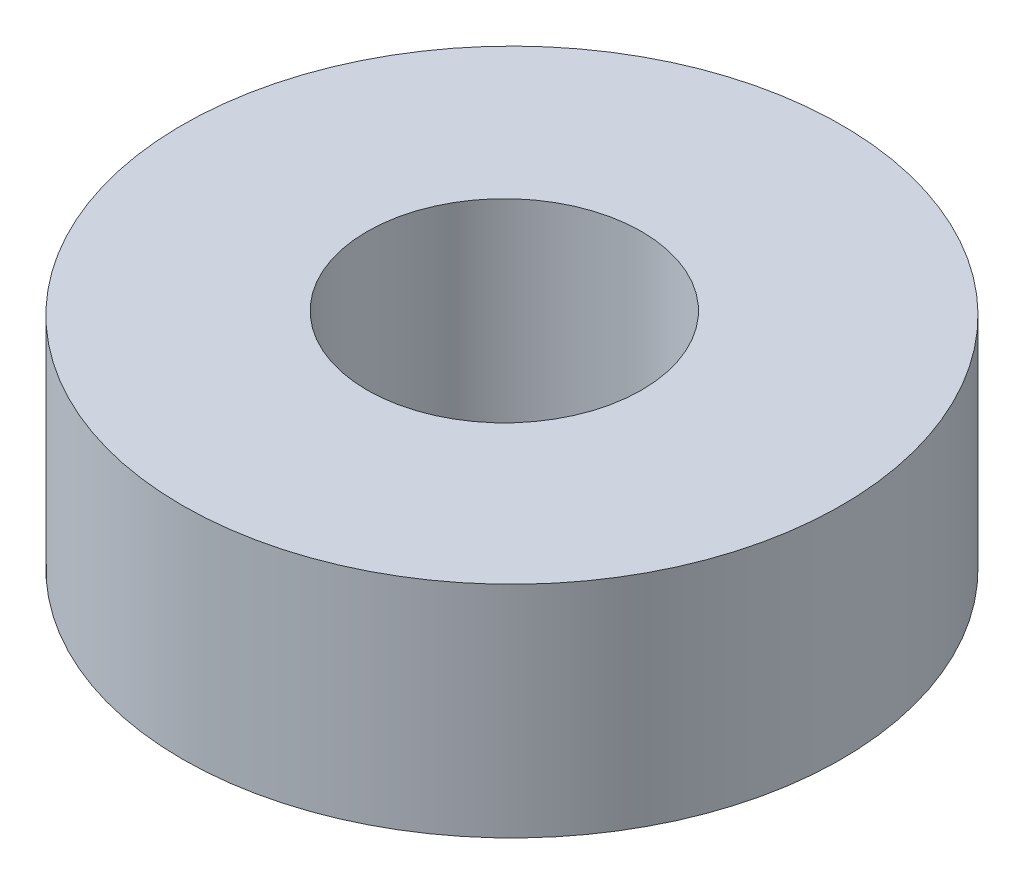
ISO-10303-21;
HEADER;
FILE_DESCRIPTION(('STEP AP214'),'2;1');
FILE_NAME('part.step','',(''),(''),'','','');
FILE_SCHEMA(('AUTOMOTIVE_DESIGN { 1 0 10303 214 1 1 1 1 }'));
ENDSEC;
DATA;
#1=APPLICATION_CONTEXT('core data for automotive mechanical design processes');
#2=APPLICATION_PROTOCOL_DEFINITION('international standard','automotive_design',2000,#1);
#3=PRODUCT_CONTEXT('',#1,'mechanical');
#4=PRODUCT('Part','Part','',(#3));
#5=PRODUCT_RELATED_PRODUCT_CATEGORY('part','',(#4));
#6=PRODUCT_DEFINITION_FORMATION('','',#4);
#7=PRODUCT_DEFINITION_CONTEXT('part definition',#1,'design');
#8=PRODUCT_DEFINITION('design','',#6,#7);
#9=PRODUCT_DEFINITION_SHAPE('','',#8);
#10=(LENGTH_UNIT() NAMED_UNIT(*) SI_UNIT(.MILLI.,.METRE.));
#11=(NAMED_UNIT(*) PLANE_ANGLE_UNIT() SI_UNIT($,.RADIAN.));
#12=(NAMED_UNIT(*) SI_UNIT($,.STERADIAN.) SOLID_ANGLE_UNIT());
#13=UNCERTAINTY_MEASURE_WITH_UNIT(LENGTH_MEASURE(1.E-05),#10,'distance_accuracy_value','');
#14=(GEOMETRIC_REPRESENTATION_CONTEXT(3) GLOBAL_UNCERTAINTY_ASSIGNED_CONTEXT((#13)) GLOBAL_UNIT_ASSIGNED_CONTEXT((#10,
#11,#12)) REPRESENTATION_CONTEXT('',''));
#15=CARTESIAN_POINT('',(0.,0.,0.));
#16=DIRECTION('',(0.,0.,1.));
#17=DIRECTION('',(1.,0.,0.));
#18=AXIS2_PLACEMENT_3D('',#15,#16,#17);
#19=CARTESIAN_POINT('',(0.138632130818502,4.,0.));
#20=DIRECTION('',(0.,1.,0.));
#21=DIRECTION('',(0.,0.,1.));
#22=AXIS2_PLACEMENT_3D('',#19,#20,#21);
#23=PLANE('',#22);
#24=CARTESIAN_POINT('',(0.138632130818502,4.,0.));
#25=DIRECTION('',(0.,1.,0.));
#26=DIRECTION('',(0.,0.,1.));
#27=AXIS2_PLACEMENT_3D('',#24,#25,#26);
#28=CIRCLE('',#27,6.);
#29=CARTESIAN_POINT('',(0.138632130818502,4.,6.));
#30=VERTEX_POINT('',#29);
#31=EDGE_CURVE('E10',#30,#30,#28,.T.);
#32=ORIENTED_EDGE('',*,*,#31,.T.);
#33=EDGE_LOOP('',(#32));
#34=FACE_BOUND('',#33,.T.);
#35=CARTESIAN_POINT('',(0.,4.,0.));
#36=DIRECTION('',(0.,1.,0.));
#37=DIRECTION('',(0.,0.,1.));
#38=AXIS2_PLACEMENT_3D('',#35,#36,#37);
#39=CIRCLE('',#38,2.5);
#40=CARTESIAN_POINT('',(0.,4.,2.5));
#41=VERTEX_POINT('',#40);
#42=EDGE_CURVE('E42',#41,#41,#39,.T.);
#43=ORIENTED_EDGE('',*,*,#42,.F.);
#44=EDGE_LOOP('',(#43));
#45=FACE_BOUND('',#44,.T.);
#46=ADVANCED_FACE('F31',(#34,#45),#23,.T.);
#47=CARTESIAN_POINT('',(0.138632130818502,0.,0.));
#48=DIRECTION('',(0.,1.,0.));
#49=DIRECTION('',(0.,0.,1.));
#50=AXIS2_PLACEMENT_3D('',#47,#48,#49);
#51=PLANE('',#50);
#52=CARTESIAN_POINT('',(0.138632130818502,0.,0.));
#53=DIRECTION('',(0.,1.,0.));
#54=DIRECTION('',(0.,0.,1.));
#55=AXIS2_PLACEMENT_3D('',#52,#53,#54);
#56=CIRCLE('',#55,6.);
#57=CARTESIAN_POINT('',(0.138632130818502,0.,6.));
#58=VERTEX_POINT('',#57);
#59=EDGE_CURVE('E35',#58,#58,#56,.T.);
#60=ORIENTED_EDGE('',*,*,#59,.F.);
#61=EDGE_LOOP('',(#60));
#62=FACE_BOUND('',#61,.T.);
#63=CARTESIAN_POINT('',(0.,0.,0.));
#64=DIRECTION('',(0.,1.,0.));
#65=DIRECTION('',(0.,0.,1.));
#66=AXIS2_PLACEMENT_3D('',#63,#64,#65);
#67=CIRCLE('',#66,2.5);
#68=CARTESIAN_POINT('',(0.,0.,2.5));
#69=VERTEX_POINT('',#68);
#70=EDGE_CURVE('E44',#69,#69,#67,.T.);
#71=ORIENTED_EDGE('',*,*,#70,.T.);
#72=EDGE_LOOP('',(#71));
#73=FACE_BOUND('',#72,.T.);
#74=ADVANCED_FACE('F54',(#62,#73),#51,.F.);
#75=CARTESIAN_POINT('',(0.138632130818502,4.,0.));
#76=DIRECTION('',(0.,-1.,0.));
#77=DIRECTION('',(0.,0.,-1.));
#78=AXIS2_PLACEMENT_3D('',#75,#76,#77);
#79=CYLINDRICAL_SURFACE('',#78,6.);
#80=ORIENTED_EDGE('',*,*,#31,.F.);
#81=EDGE_LOOP('',(#80));
#82=FACE_BOUND('',#81,.T.);
#83=ORIENTED_EDGE('',*,*,#59,.T.);
#84=EDGE_LOOP('',(#83));
#85=FACE_BOUND('',#84,.T.);
#86=ADVANCED_FACE('F33',(#82,#85),#79,.T.);
#87=CARTESIAN_POINT('',(0.,4.,0.));
#88=DIRECTION('',(0.,-1.,0.));
#89=DIRECTION('',(0.,0.,-1.));
#90=AXIS2_PLACEMENT_3D('',#87,#88,#89);
#91=CYLINDRICAL_SURFACE('',#90,2.5);
#92=ORIENTED_EDGE('',*,*,#42,.T.);
#93=EDGE_LOOP('',(#92));
#94=FACE_BOUND('',#93,.T.);
#95=ORIENTED_EDGE('',*,*,#70,.F.);
#96=EDGE_LOOP('',(#95));
#97=FACE_BOUND('',#96,.T.);
#98=ADVANCED_FACE('F50',(#94,#97),#91,.F.);
#99=CLOSED_SHELL('',(#46,#74,#86,#98));
#100=MANIFOLD_SOLID_BREP('B2',#99);
#101=ADVANCED_BREP_SHAPE_REPRESENTATION('',(#18,#100),#14);
#102=SHAPE_DEFINITION_REPRESENTATION(#9,#101);
ENDSEC;
END-ISO-10303-21;
